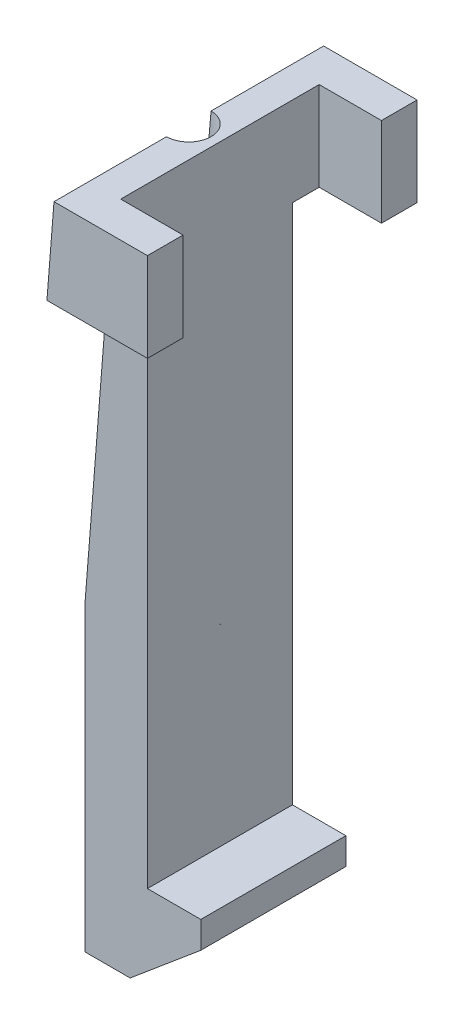
ISO-10303-21;
HEADER;
FILE_DESCRIPTION(('STEP AP214'),'2;1');
FILE_NAME('part.step','',(''),(''),'','','');
FILE_SCHEMA(('AUTOMOTIVE_DESIGN { 1 0 10303 214 1 1 1 1 }'));
ENDSEC;
DATA;
#1=APPLICATION_CONTEXT('core data for automotive mechanical design processes');
#2=APPLICATION_PROTOCOL_DEFINITION('international standard','automotive_design',2000,#1);
#3=PRODUCT_CONTEXT('',#1,'mechanical');
#4=PRODUCT('Part','Part','',(#3));
#5=PRODUCT_RELATED_PRODUCT_CATEGORY('part','',(#4));
#6=PRODUCT_DEFINITION_FORMATION('','',#4);
#7=PRODUCT_DEFINITION_CONTEXT('part definition',#1,'design');
#8=PRODUCT_DEFINITION('design','',#6,#7);
#9=PRODUCT_DEFINITION_SHAPE('','',#8);
#10=(LENGTH_UNIT() NAMED_UNIT(*) SI_UNIT(.MILLI.,.METRE.));
#11=(NAMED_UNIT(*) PLANE_ANGLE_UNIT() SI_UNIT($,.RADIAN.));
#12=(NAMED_UNIT(*) SI_UNIT($,.STERADIAN.) SOLID_ANGLE_UNIT());
#13=UNCERTAINTY_MEASURE_WITH_UNIT(LENGTH_MEASURE(1.E-05),#10,'distance_accuracy_value','');
#14=(GEOMETRIC_REPRESENTATION_CONTEXT(3) GLOBAL_UNCERTAINTY_ASSIGNED_CONTEXT((#13)) GLOBAL_UNIT_ASSIGNED_CONTEXT((#10,
#11,#12)) REPRESENTATION_CONTEXT('',''));
#15=CARTESIAN_POINT('',(0.,0.,0.));
#16=DIRECTION('',(0.,0.,1.));
#17=DIRECTION('',(1.,0.,0.));
#18=AXIS2_PLACEMENT_3D('',#15,#16,#17);
#19=CARTESIAN_POINT('',(0.,0.,-1.83));
#20=DIRECTION('',(0.,0.,-1.));
#21=DIRECTION('',(-1.,0.,0.));
#22=AXIS2_PLACEMENT_3D('',#19,#20,#21);
#23=PLANE('',#22);
#24=DIRECTION('',(0.,-1.,0.));
#25=VECTOR('',#24,1.);
#26=CARTESIAN_POINT('',(-1.2,-5.66735219900528,-1.83));
#27=LINE('',#26,#25);
#28=CARTESIAN_POINT('',(-1.2,-2.25367609950264,-1.83));
#29=VERTEX_POINT('',#28);
#30=CARTESIAN_POINT('',(-1.2,-5.66735219900528,-1.83));
#31=VERTEX_POINT('',#30);
#32=EDGE_CURVE('E251',#29,#31,#27,.T.);
#33=ORIENTED_EDGE('',*,*,#32,.F.);
#34=DIRECTION('',(0.0790508179017554,0.996870587483182,0.));
#35=VECTOR('',#34,1.);
#36=CARTESIAN_POINT('',(-1.01490374317144,0.0804808287019596,-1.83));
#37=LINE('',#36,#35);
#38=CARTESIAN_POINT('',(-0.929298977113306,1.16,-1.83));
#39=VERTEX_POINT('',#38);
#40=EDGE_CURVE('E181',#29,#39,#37,.T.);
#41=ORIENTED_EDGE('',*,*,#40,.T.);
#42=DIRECTION('',(-1.,0.,0.));
#43=VECTOR('',#42,1.);
#44=CARTESIAN_POINT('',(-0.500000000000001,1.16,-1.83));
#45=LINE('',#44,#43);
#46=CARTESIAN_POINT('',(-0.500000000000001,1.16,-1.83));
#47=VERTEX_POINT('',#46);
#48=EDGE_CURVE('E207',#47,#39,#45,.T.);
#49=ORIENTED_EDGE('',*,*,#48,.F.);
#50=DIRECTION('',(0.,1.,0.));
#51=VECTOR('',#50,1.);
#52=CARTESIAN_POINT('',(-0.500000000000001,2.16,-1.83));
#53=LINE('',#52,#51);
#54=CARTESIAN_POINT('',(-0.5,-4.7,-1.83));
#55=VERTEX_POINT('',#54);
#56=EDGE_CURVE('E267',#55,#47,#53,.T.);
#57=ORIENTED_EDGE('',*,*,#56,.F.);
#58=DIRECTION('',(-1.,0.,0.));
#59=VECTOR('',#58,1.);
#60=CARTESIAN_POINT('',(-0.5,-4.7,-1.83));
#61=LINE('',#60,#59);
#62=CARTESIAN_POINT('',(0.0999999999999996,-4.7,-1.83));
#63=VERTEX_POINT('',#62);
#64=EDGE_CURVE('E272',#63,#55,#61,.T.);
#65=ORIENTED_EDGE('',*,*,#64,.F.);
#66=DIRECTION('',(0.,1.,0.));
#67=VECTOR('',#66,1.);
#68=CARTESIAN_POINT('',(0.0999999999999996,-4.7,-1.83));
#69=LINE('',#68,#67);
#70=CARTESIAN_POINT('',(0.0999999999999996,-5.00079321743203,-1.83));
#71=VERTEX_POINT('',#70);
#72=EDGE_CURVE('E276',#71,#63,#69,.T.);
#73=ORIENTED_EDGE('',*,*,#72,.F.);
#74=DIRECTION('',(0.766044443118977,0.64278760968654,0.));
#75=VECTOR('',#74,1.);
#76=CARTESIAN_POINT('',(0.0999999999999996,-5.00079321743203,-1.83));
#77=LINE('',#76,#75);
#78=CARTESIAN_POINT('',(-0.694374060965859,-5.66735219900528,-1.83));
#79=VERTEX_POINT('',#78);
#80=EDGE_CURVE('E280',#79,#71,#77,.T.);
#81=ORIENTED_EDGE('',*,*,#80,.F.);
#82=DIRECTION('',(1.,0.,0.));
#83=VECTOR('',#82,1.);
#84=CARTESIAN_POINT('',(-0.694374060965859,-5.66735219900528,-1.83));
#85=LINE('',#84,#83);
#86=EDGE_CURVE('E284',#31,#79,#85,.T.);
#87=ORIENTED_EDGE('',*,*,#86,.F.);
#88=EDGE_LOOP('',(#33,#41,#49,#57,#65,#73,#81,#87));
#89=FACE_BOUND('',#88,.T.);
#90=ADVANCED_FACE('F37',(#89),#23,.T.);
#91=CARTESIAN_POINT('',(0.,0.,-0.2));
#92=DIRECTION('',(0.,0.,-1.));
#93=DIRECTION('',(-1.,0.,0.));
#94=AXIS2_PLACEMENT_3D('',#91,#92,#93);
#95=PLANE('',#94);
#96=DIRECTION('',(0.0790508179017554,0.996870587483182,0.));
#97=VECTOR('',#96,1.);
#98=CARTESIAN_POINT('',(-1.01490374317144,0.0804808287019595,-0.2));
#99=LINE('',#98,#97);
#100=CARTESIAN_POINT('',(-1.2,-2.25367609950264,-0.200000000000001));
#101=VERTEX_POINT('',#100);
#102=CARTESIAN_POINT('',(-0.929298977113306,1.16,-0.2));
#103=VERTEX_POINT('',#102);
#104=EDGE_CURVE('E187',#101,#103,#99,.T.);
#105=ORIENTED_EDGE('',*,*,#104,.F.);
#106=DIRECTION('',(0.,-1.,0.));
#107=VECTOR('',#106,1.);
#108=CARTESIAN_POINT('',(-1.2,-5.66735219900528,-0.2));
#109=LINE('',#108,#107);
#110=CARTESIAN_POINT('',(-1.2,-5.66735219900528,-0.2));
#111=VERTEX_POINT('',#110);
#112=EDGE_CURVE('E247',#101,#111,#109,.T.);
#113=ORIENTED_EDGE('',*,*,#112,.T.);
#114=DIRECTION('',(1.,0.,0.));
#115=VECTOR('',#114,1.);
#116=CARTESIAN_POINT('',(-0.694374060965859,-5.66735219900528,-0.2));
#117=LINE('',#116,#115);
#118=CARTESIAN_POINT('',(-0.694374060965859,-5.66735219900528,-0.2));
#119=VERTEX_POINT('',#118);
#120=EDGE_CURVE('E261',#111,#119,#117,.T.);
#121=ORIENTED_EDGE('',*,*,#120,.T.);
#122=DIRECTION('',(0.766044443118977,0.64278760968654,0.));
#123=VECTOR('',#122,1.);
#124=CARTESIAN_POINT('',(0.0999999999999996,-5.00079321743203,-0.2));
#125=LINE('',#124,#123);
#126=CARTESIAN_POINT('',(0.0999999999999996,-5.00079321743203,-0.2));
#127=VERTEX_POINT('',#126);
#128=EDGE_CURVE('E258',#119,#127,#125,.T.);
#129=ORIENTED_EDGE('',*,*,#128,.T.);
#130=DIRECTION('',(0.,1.,0.));
#131=VECTOR('',#130,1.);
#132=CARTESIAN_POINT('',(0.0999999999999996,-4.7,-0.2));
#133=LINE('',#132,#131);
#134=CARTESIAN_POINT('',(0.0999999999999996,-4.7,-0.2));
#135=VERTEX_POINT('',#134);
#136=EDGE_CURVE('E255',#127,#135,#133,.T.);
#137=ORIENTED_EDGE('',*,*,#136,.T.);
#138=DIRECTION('',(-1.,0.,0.));
#139=VECTOR('',#138,1.);
#140=CARTESIAN_POINT('',(-0.5,-4.7,-0.2));
#141=LINE('',#140,#139);
#142=CARTESIAN_POINT('',(-0.5,-4.7,-0.2));
#143=VERTEX_POINT('',#142);
#144=EDGE_CURVE('E252',#135,#143,#141,.T.);
#145=ORIENTED_EDGE('',*,*,#144,.T.);
#146=DIRECTION('',(0.,1.,0.));
#147=VECTOR('',#146,1.);
#148=CARTESIAN_POINT('',(-0.500000000000001,2.16,-0.2));
#149=LINE('',#148,#147);
#150=CARTESIAN_POINT('',(-0.500000000000001,1.16,-0.2));
#151=VERTEX_POINT('',#150);
#152=EDGE_CURVE('E248',#143,#151,#149,.T.);
#153=ORIENTED_EDGE('',*,*,#152,.T.);
#154=DIRECTION('',(-1.,0.,0.));
#155=VECTOR('',#154,1.);
#156=CARTESIAN_POINT('',(-0.500000000000001,1.16,-0.2));
#157=LINE('',#156,#155);
#158=EDGE_CURVE('E237',#151,#103,#157,.T.);
#159=ORIENTED_EDGE('',*,*,#158,.T.);
#160=EDGE_LOOP('',(#105,#113,#121,#129,#137,#145,#153,#159));
#161=FACE_BOUND('',#160,.T.);
#162=ADVANCED_FACE('F321',(#161),#95,.F.);
#163=CARTESIAN_POINT('',(-1.2,-5.66735219900528,-9.9645726064655));
#164=DIRECTION('',(-1.,0.,0.));
#165=DIRECTION('',(0.,0.,1.));
#166=AXIS2_PLACEMENT_3D('',#163,#164,#165);
#167=PLANE('',#166);
#168=ORIENTED_EDGE('',*,*,#112,.F.);
#169=DIRECTION('',(0.,0.,-1.));
#170=VECTOR('',#169,1.);
#171=CARTESIAN_POINT('',(-1.2,-2.25367609950264,0.5));
#172=LINE('',#171,#170);
#173=EDGE_CURVE('E172',#101,#29,#172,.T.);
#174=ORIENTED_EDGE('',*,*,#173,.T.);
#175=ORIENTED_EDGE('',*,*,#32,.T.);
#176=DIRECTION('',(0.,0.,1.));
#177=VECTOR('',#176,1.);
#178=CARTESIAN_POINT('',(-1.2,-5.66735219900528,-9.9645726064655));
#179=LINE('',#178,#177);
#180=EDGE_CURVE('E266',#31,#111,#179,.T.);
#181=ORIENTED_EDGE('',*,*,#180,.T.);
#182=EDGE_LOOP('',(#168,#174,#175,#181));
#183=FACE_BOUND('',#182,.T.);
#184=ADVANCED_FACE('F317',(#183),#167,.T.);
#185=CARTESIAN_POINT('',(-1.2,2.16,-9.9645726064655));
#186=DIRECTION('',(0.,1.,0.));
#187=DIRECTION('',(-1.,0.,0.));
#188=AXIS2_PLACEMENT_3D('',#185,#186,#187);
#189=PLANE('',#188);
#190=CARTESIAN_POINT('',(-0.850000000000001,2.16,-1.015));
#191=DIRECTION('',(0.,1.,0.));
#192=DIRECTION('',(-1.,0.,0.));
#193=AXIS2_PLACEMENT_3D('',#190,#191,#192);
#194=CIRCLE('',#193,0.25);
#195=CARTESIAN_POINT('',(-0.850000000000001,2.16,-0.764999999999999));
#196=VERTEX_POINT('',#195);
#197=CARTESIAN_POINT('',(-0.850000000000001,2.16,-1.265));
#198=VERTEX_POINT('',#197);
#199=EDGE_CURVE('E56',#196,#198,#194,.T.);
#200=ORIENTED_EDGE('',*,*,#199,.F.);
#201=DIRECTION('',(0.,0.,-1.));
#202=VECTOR('',#201,1.);
#203=CARTESIAN_POINT('',(-0.850000000000001,2.16,0.5));
#204=LINE('',#203,#202);
#205=CARTESIAN_POINT('',(-0.850000000000001,2.16,0.5));
#206=VERTEX_POINT('',#205);
#207=EDGE_CURVE('E164',#206,#196,#204,.T.);
#208=ORIENTED_EDGE('',*,*,#207,.F.);
#209=DIRECTION('',(-1.,0.,0.));
#210=VECTOR('',#209,1.);
#211=CARTESIAN_POINT('',(-0.500000000000001,2.16,0.5));
#212=LINE('',#211,#210);
#213=CARTESIAN_POINT('',(0.199999999999999,2.16,0.5));
#214=VERTEX_POINT('',#213);
#215=EDGE_CURVE('E238',#214,#206,#212,.T.);
#216=ORIENTED_EDGE('',*,*,#215,.F.);
#217=DIRECTION('',(0.,0.,-1.));
#218=VECTOR('',#217,1.);
#219=CARTESIAN_POINT('',(0.199999999999999,2.16,0.5));
#220=LINE('',#219,#218);
#221=CARTESIAN_POINT('',(0.199999999999999,2.16,0.1));
#222=VERTEX_POINT('',#221);
#223=EDGE_CURVE('E223',#214,#222,#220,.T.);
#224=ORIENTED_EDGE('',*,*,#223,.T.);
#225=DIRECTION('',(-1.,0.,0.));
#226=VECTOR('',#225,1.);
#227=CARTESIAN_POINT('',(0.199999999999999,2.16,0.1));
#228=LINE('',#227,#226);
#229=CARTESIAN_POINT('',(-0.500000000000001,2.16,0.0999999999999994));
#230=VERTEX_POINT('',#229);
#231=EDGE_CURVE('E229',#222,#230,#228,.T.);
#232=ORIENTED_EDGE('',*,*,#231,.T.);
#233=DIRECTION('',(0.,0.,1.));
#234=VECTOR('',#233,1.);
#235=CARTESIAN_POINT('',(-0.500000000000001,2.16,-9.9645726064655));
#236=LINE('',#235,#234);
#237=CARTESIAN_POINT('',(-0.500000000000001,2.16,-2.13));
#238=VERTEX_POINT('',#237);
#239=EDGE_CURVE('E270',#238,#230,#236,.T.);
#240=ORIENTED_EDGE('',*,*,#239,.F.);
#241=DIRECTION('',(-1.,0.,0.));
#242=VECTOR('',#241,1.);
#243=CARTESIAN_POINT('',(0.199999999999999,2.16,-2.13));
#244=LINE('',#243,#242);
#245=CARTESIAN_POINT('',(0.199999999999999,2.16,-2.13));
#246=VERTEX_POINT('',#245);
#247=EDGE_CURVE('E205',#246,#238,#244,.T.);
#248=ORIENTED_EDGE('',*,*,#247,.F.);
#249=DIRECTION('',(0.,0.,1.));
#250=VECTOR('',#249,1.);
#251=CARTESIAN_POINT('',(0.199999999999999,2.16,-2.53));
#252=LINE('',#251,#250);
#253=CARTESIAN_POINT('',(0.199999999999999,2.16,-2.53));
#254=VERTEX_POINT('',#253);
#255=EDGE_CURVE('E196',#254,#246,#252,.T.);
#256=ORIENTED_EDGE('',*,*,#255,.F.);
#257=DIRECTION('',(-1.,0.,0.));
#258=VECTOR('',#257,1.);
#259=CARTESIAN_POINT('',(-0.500000000000001,2.16,-2.53));
#260=LINE('',#259,#258);
#261=CARTESIAN_POINT('',(-0.850000000000001,2.16,-2.53));
#262=VERTEX_POINT('',#261);
#263=EDGE_CURVE('E208',#254,#262,#260,.T.);
#264=ORIENTED_EDGE('',*,*,#263,.T.);
#265=EDGE_CURVE('E167',#198,#262,#204,.T.);
#266=ORIENTED_EDGE('',*,*,#265,.F.);
#267=EDGE_LOOP('',(#200,#208,#216,#224,#232,#240,#248,#256,#264,#266));
#268=FACE_BOUND('',#267,.T.);
#269=ADVANCED_FACE('F163',(#268),#189,.T.);
#270=CARTESIAN_POINT('',(-0.500000000000001,1.16,0.5));
#271=DIRECTION('',(0.,-1.,0.));
#272=DIRECTION('',(1.,0.,0.));
#273=AXIS2_PLACEMENT_3D('',#270,#271,#272);
#274=PLANE('',#273);
#275=DIRECTION('',(-1.,0.,0.));
#276=VECTOR('',#275,1.);
#277=CARTESIAN_POINT('',(-0.500000000000001,1.16,0.5));
#278=LINE('',#277,#276);
#279=CARTESIAN_POINT('',(0.199999999999999,1.16,0.5));
#280=VERTEX_POINT('',#279);
#281=CARTESIAN_POINT('',(-0.929298977113306,1.16,0.5));
#282=VERTEX_POINT('',#281);
#283=EDGE_CURVE('E240',#280,#282,#278,.T.);
#284=ORIENTED_EDGE('',*,*,#283,.T.);
#285=DIRECTION('',(0.,0.,-1.));
#286=VECTOR('',#285,1.);
#287=CARTESIAN_POINT('',(-0.929298977113306,1.16,0.5));
#288=LINE('',#287,#286);
#289=EDGE_CURVE('E184',#282,#103,#288,.T.);
#290=ORIENTED_EDGE('',*,*,#289,.T.);
#291=ORIENTED_EDGE('',*,*,#158,.F.);
#292=DIRECTION('',(0.,0.,-1.));
#293=VECTOR('',#292,1.);
#294=CARTESIAN_POINT('',(-0.500000000000001,1.16,0.5));
#295=LINE('',#294,#293);
#296=CARTESIAN_POINT('',(-0.500000000000001,1.16,0.1));
#297=VERTEX_POINT('',#296);
#298=EDGE_CURVE('E243',#297,#151,#295,.T.);
#299=ORIENTED_EDGE('',*,*,#298,.F.);
#300=DIRECTION('',(-1.,0.,0.));
#301=VECTOR('',#300,1.);
#302=CARTESIAN_POINT('',(0.199999999999999,1.16,0.1));
#303=LINE('',#302,#301);
#304=CARTESIAN_POINT('',(0.199999999999999,1.16,0.1));
#305=VERTEX_POINT('',#304);
#306=EDGE_CURVE('E234',#305,#297,#303,.T.);
#307=ORIENTED_EDGE('',*,*,#306,.F.);
#308=DIRECTION('',(0.,0.,-1.));
#309=VECTOR('',#308,1.);
#310=CARTESIAN_POINT('',(0.199999999999999,1.16,0.5));
#311=LINE('',#310,#309);
#312=EDGE_CURVE('E218',#280,#305,#311,.T.);
#313=ORIENTED_EDGE('',*,*,#312,.F.);
#314=EDGE_LOOP('',(#284,#290,#291,#299,#307,#313));
#315=FACE_BOUND('',#314,.T.);
#316=ADVANCED_FACE('F326',(#315),#274,.T.);
#317=CARTESIAN_POINT('',(0.,0.,0.5));
#318=DIRECTION('',(0.,0.,1.));
#319=DIRECTION('',(1.,0.,0.));
#320=AXIS2_PLACEMENT_3D('',#317,#318,#319);
#321=PLANE('',#320);
#322=ORIENTED_EDGE('',*,*,#215,.T.);
#323=DIRECTION('',(0.0790508179017554,0.996870587483181,0.));
#324=VECTOR('',#323,1.);
#325=CARTESIAN_POINT('',(-0.850000000000001,2.16,0.5));
#326=LINE('',#325,#324);
#327=EDGE_CURVE('E171',#282,#206,#326,.T.);
#328=ORIENTED_EDGE('',*,*,#327,.F.);
#329=ORIENTED_EDGE('',*,*,#283,.F.);
#330=DIRECTION('',(0.,1.,0.));
#331=VECTOR('',#330,1.);
#332=CARTESIAN_POINT('',(0.199999999999999,1.16,0.5));
#333=LINE('',#332,#331);
#334=EDGE_CURVE('E226',#280,#214,#333,.T.);
#335=ORIENTED_EDGE('',*,*,#334,.T.);
#336=EDGE_LOOP('',(#322,#328,#329,#335));
#337=FACE_BOUND('',#336,.T.);
#338=ADVANCED_FACE('F330',(#337),#321,.T.);
#339=CARTESIAN_POINT('',(-0.500000000000001,1.16,-2.53));
#340=DIRECTION('',(0.,1.,0.));
#341=DIRECTION('',(-1.,0.,0.));
#342=AXIS2_PLACEMENT_3D('',#339,#340,#341);
#343=PLANE('',#342);
#344=DIRECTION('',(0.,0.,1.));
#345=VECTOR('',#344,1.);
#346=CARTESIAN_POINT('',(-0.929298977113306,1.16,-2.53));
#347=LINE('',#346,#345);
#348=CARTESIAN_POINT('',(-0.929298977113306,1.16,-2.53));
#349=VERTEX_POINT('',#348);
#350=EDGE_CURVE('E175',#349,#39,#347,.T.);
#351=ORIENTED_EDGE('',*,*,#350,.F.);
#352=DIRECTION('',(-1.,0.,0.));
#353=VECTOR('',#352,1.);
#354=CARTESIAN_POINT('',(-0.500000000000001,1.16,-2.53));
#355=LINE('',#354,#353);
#356=CARTESIAN_POINT('',(0.199999999999999,1.16,-2.53));
#357=VERTEX_POINT('',#356);
#358=EDGE_CURVE('E210',#357,#349,#355,.T.);
#359=ORIENTED_EDGE('',*,*,#358,.F.);
#360=DIRECTION('',(0.,0.,1.));
#361=VECTOR('',#360,1.);
#362=CARTESIAN_POINT('',(0.199999999999999,1.16,-2.53));
#363=LINE('',#362,#361);
#364=CARTESIAN_POINT('',(0.199999999999999,1.16,-2.13));
#365=VERTEX_POINT('',#364);
#366=EDGE_CURVE('E190',#357,#365,#363,.T.);
#367=ORIENTED_EDGE('',*,*,#366,.T.);
#368=DIRECTION('',(-1.,0.,0.));
#369=VECTOR('',#368,1.);
#370=CARTESIAN_POINT('',(0.199999999999999,1.16,-2.13));
#371=LINE('',#370,#369);
#372=CARTESIAN_POINT('',(-0.500000000000001,1.16,-2.13));
#373=VERTEX_POINT('',#372);
#374=EDGE_CURVE('E201',#365,#373,#371,.T.);
#375=ORIENTED_EDGE('',*,*,#374,.T.);
#376=DIRECTION('',(0.,0.,1.));
#377=VECTOR('',#376,1.);
#378=CARTESIAN_POINT('',(-0.500000000000001,1.16,-2.53));
#379=LINE('',#378,#377);
#380=EDGE_CURVE('E213',#373,#47,#379,.T.);
#381=ORIENTED_EDGE('',*,*,#380,.T.);
#382=ORIENTED_EDGE('',*,*,#48,.T.);
#383=EDGE_LOOP('',(#351,#359,#367,#375,#381,#382));
#384=FACE_BOUND('',#383,.T.);
#385=ADVANCED_FACE('F308',(#384),#343,.F.);
#386=CARTESIAN_POINT('',(0.,0.,-2.53));
#387=DIRECTION('',(0.,0.,-1.));
#388=DIRECTION('',(1.,0.,0.));
#389=AXIS2_PLACEMENT_3D('',#386,#387,#388);
#390=PLANE('',#389);
#391=ORIENTED_EDGE('',*,*,#358,.T.);
#392=DIRECTION('',(0.0790508179017554,0.996870587483182,0.));
#393=VECTOR('',#392,1.);
#394=CARTESIAN_POINT('',(-1.01490374317144,0.0804808287019595,-2.53));
#395=LINE('',#394,#393);
#396=EDGE_CURVE('E44',#349,#262,#395,.T.);
#397=ORIENTED_EDGE('',*,*,#396,.T.);
#398=ORIENTED_EDGE('',*,*,#263,.F.);
#399=DIRECTION('',(0.,1.,0.));
#400=VECTOR('',#399,1.);
#401=CARTESIAN_POINT('',(0.199999999999999,1.16,-2.53));
#402=LINE('',#401,#400);
#403=EDGE_CURVE('E193',#357,#254,#402,.T.);
#404=ORIENTED_EDGE('',*,*,#403,.F.);
#405=EDGE_LOOP('',(#391,#397,#398,#404));
#406=FACE_BOUND('',#405,.T.);
#407=ADVANCED_FACE('F297',(#406),#390,.T.);
#408=CARTESIAN_POINT('',(-0.500000000000001,2.16,-9.9645726064655));
#409=DIRECTION('',(1.,0.,0.));
#410=DIRECTION('',(0.,1.,0.));
#411=AXIS2_PLACEMENT_3D('',#408,#409,#410);
#412=PLANE('',#411);
#413=DIRECTION('',(0.,1.,0.));
#414=VECTOR('',#413,1.);
#415=CARTESIAN_POINT('',(-0.500000000000001,1.16,-2.13));
#416=LINE('',#415,#414);
#417=EDGE_CURVE('E189',#373,#238,#416,.T.);
#418=ORIENTED_EDGE('',*,*,#417,.T.);
#419=ORIENTED_EDGE('',*,*,#239,.T.);
#420=DIRECTION('',(0.,1.,0.));
#421=VECTOR('',#420,1.);
#422=CARTESIAN_POINT('',(-0.500000000000001,1.16,0.1));
#423=LINE('',#422,#421);
#424=EDGE_CURVE('E217',#297,#230,#423,.T.);
#425=ORIENTED_EDGE('',*,*,#424,.F.);
#426=ORIENTED_EDGE('',*,*,#298,.T.);
#427=ORIENTED_EDGE('',*,*,#152,.F.);
#428=DIRECTION('',(0.,0.,1.));
#429=VECTOR('',#428,1.);
#430=CARTESIAN_POINT('',(-0.5,-4.7,-9.9645726064655));
#431=LINE('',#430,#429);
#432=EDGE_CURVE('E271',#55,#143,#431,.T.);
#433=ORIENTED_EDGE('',*,*,#432,.F.);
#434=ORIENTED_EDGE('',*,*,#56,.T.);
#435=ORIENTED_EDGE('',*,*,#380,.F.);
#436=EDGE_LOOP('',(#418,#419,#425,#426,#427,#433,#434,#435));
#437=FACE_BOUND('',#436,.T.);
#438=ADVANCED_FACE('F350',(#437),#412,.T.);
#439=CARTESIAN_POINT('',(-0.694374060965859,-5.66735219900528,-9.9645726064655));
#440=DIRECTION('',(0.,-1.,0.));
#441=DIRECTION('',(0.,0.,-1.));
#442=AXIS2_PLACEMENT_3D('',#439,#440,#441);
#443=PLANE('',#442);
#444=CARTESIAN_POINT('',(-0.850000000000007,-5.66735219900528,-1.015));
#445=DIRECTION('',(0.,1.,0.));
#446=DIRECTION('',(-1.,0.,0.));
#447=AXIS2_PLACEMENT_3D('',#444,#445,#446);
#448=CIRCLE('',#447,0.25);
#449=CARTESIAN_POINT('',(-0.694374060965859,-5.66735219900528,-1.21065420286756));
#450=VERTEX_POINT('',#449);
#451=CARTESIAN_POINT('',(-0.694374060965859,-5.66735219900528,-0.819345797132441));
#452=VERTEX_POINT('',#451);
#453=EDGE_CURVE('E50',#450,#452,#448,.T.);
#454=ORIENTED_EDGE('',*,*,#453,.T.);
#455=DIRECTION('',(0.,0.,1.));
#456=VECTOR('',#455,1.);
#457=CARTESIAN_POINT('',(-0.694374060965859,-5.66735219900528,-9.9645726064655));
#458=LINE('',#457,#456);
#459=EDGE_CURVE('E287',#452,#119,#458,.T.);
#460=ORIENTED_EDGE('',*,*,#459,.T.);
#461=ORIENTED_EDGE('',*,*,#120,.F.);
#462=ORIENTED_EDGE('',*,*,#180,.F.);
#463=ORIENTED_EDGE('',*,*,#86,.T.);
#464=EDGE_CURVE('E283',#79,#450,#458,.T.);
#465=ORIENTED_EDGE('',*,*,#464,.T.);
#466=EDGE_LOOP('',(#454,#460,#461,#462,#463,#465));
#467=FACE_BOUND('',#466,.T.);
#468=ADVANCED_FACE('F335',(#467),#443,.T.);
#469=CARTESIAN_POINT('',(0.0999999999999996,-5.00079321743203,-9.9645726064655));
#470=DIRECTION('',(0.64278760968654,-0.766044443118977,0.));
#471=DIRECTION('',(0.766044443118977,0.64278760968654,0.));
#472=AXIS2_PLACEMENT_3D('',#469,#470,#471);
#473=PLANE('',#472);
#474=CARTESIAN_POINT('',(-0.850000000000007,-5.79793786705045,-1.015));
#475=DIRECTION('',(0.64278760968654,-0.766044443118977,0.));
#476=DIRECTION('',(0.766044443118977,0.64278760968654,0.));
#477=AXIS2_PLACEMENT_3D('',#474,#475,#476);
#478=ELLIPSE('',#477,0.32635182233307,0.25);
#479=EDGE_CURVE('E331',#450,#452,#478,.T.);
#480=ORIENTED_EDGE('',*,*,#479,.F.);
#481=ORIENTED_EDGE('',*,*,#464,.F.);
#482=ORIENTED_EDGE('',*,*,#80,.T.);
#483=DIRECTION('',(0.,0.,1.));
#484=VECTOR('',#483,1.);
#485=CARTESIAN_POINT('',(0.0999999999999996,-5.00079321743203,-9.9645726064655));
#486=LINE('',#485,#484);
#487=EDGE_CURVE('E279',#71,#127,#486,.T.);
#488=ORIENTED_EDGE('',*,*,#487,.T.);
#489=ORIENTED_EDGE('',*,*,#128,.F.);
#490=ORIENTED_EDGE('',*,*,#459,.F.);
#491=EDGE_LOOP('',(#480,#481,#482,#488,#489,#490));
#492=FACE_BOUND('',#491,.T.);
#493=ADVANCED_FACE('F339',(#492),#473,.T.);
#494=CARTESIAN_POINT('',(0.0999999999999996,-4.7,-9.9645726064655));
#495=DIRECTION('',(1.,0.,0.));
#496=DIRECTION('',(0.,1.,0.));
#497=AXIS2_PLACEMENT_3D('',#494,#495,#496);
#498=PLANE('',#497);
#499=ORIENTED_EDGE('',*,*,#487,.F.);
#500=ORIENTED_EDGE('',*,*,#72,.T.);
#501=DIRECTION('',(0.,0.,1.));
#502=VECTOR('',#501,1.);
#503=CARTESIAN_POINT('',(0.0999999999999996,-4.7,-9.9645726064655));
#504=LINE('',#503,#502);
#505=EDGE_CURVE('E275',#63,#135,#504,.T.);
#506=ORIENTED_EDGE('',*,*,#505,.T.);
#507=ORIENTED_EDGE('',*,*,#136,.F.);
#508=EDGE_LOOP('',(#499,#500,#506,#507));
#509=FACE_BOUND('',#508,.T.);
#510=ADVANCED_FACE('F344',(#509),#498,.T.);
#511=CARTESIAN_POINT('',(-0.5,-4.7,-9.9645726064655));
#512=DIRECTION('',(0.,1.,0.));
#513=DIRECTION('',(0.,0.,1.));
#514=AXIS2_PLACEMENT_3D('',#511,#512,#513);
#515=PLANE('',#514);
#516=ORIENTED_EDGE('',*,*,#505,.F.);
#517=ORIENTED_EDGE('',*,*,#64,.T.);
#518=ORIENTED_EDGE('',*,*,#432,.T.);
#519=ORIENTED_EDGE('',*,*,#144,.F.);
#520=EDGE_LOOP('',(#516,#517,#518,#519));
#521=FACE_BOUND('',#520,.T.);
#522=ADVANCED_FACE('F347',(#521),#515,.T.);
#523=CARTESIAN_POINT('',(0.199999999999999,1.16,0.1));
#524=DIRECTION('',(0.,0.,1.));
#525=DIRECTION('',(0.,-1.,0.));
#526=AXIS2_PLACEMENT_3D('',#523,#524,#525);
#527=PLANE('',#526);
#528=ORIENTED_EDGE('',*,*,#424,.T.);
#529=ORIENTED_EDGE('',*,*,#231,.F.);
#530=DIRECTION('',(0.,1.,0.));
#531=VECTOR('',#530,1.);
#532=CARTESIAN_POINT('',(0.199999999999999,1.16,0.1));
#533=LINE('',#532,#531);
#534=EDGE_CURVE('E221',#305,#222,#533,.T.);
#535=ORIENTED_EDGE('',*,*,#534,.F.);
#536=ORIENTED_EDGE('',*,*,#306,.T.);
#537=EDGE_LOOP('',(#528,#529,#535,#536));
#538=FACE_BOUND('',#537,.T.);
#539=ADVANCED_FACE('F354',(#538),#527,.F.);
#540=CARTESIAN_POINT('',(0.199999999999999,0.,0.));
#541=DIRECTION('',(1.,0.,0.));
#542=DIRECTION('',(0.,1.,0.));
#543=AXIS2_PLACEMENT_3D('',#540,#541,#542);
#544=PLANE('',#543);
#545=ORIENTED_EDGE('',*,*,#312,.T.);
#546=ORIENTED_EDGE('',*,*,#534,.T.);
#547=ORIENTED_EDGE('',*,*,#223,.F.);
#548=ORIENTED_EDGE('',*,*,#334,.F.);
#549=EDGE_LOOP('',(#545,#546,#547,#548));
#550=FACE_BOUND('',#549,.T.);
#551=ADVANCED_FACE('F358',(#550),#544,.T.);
#552=CARTESIAN_POINT('',(0.199999999999999,1.16,-2.13));
#553=DIRECTION('',(0.,0.,1.));
#554=DIRECTION('',(0.,-1.,0.));
#555=AXIS2_PLACEMENT_3D('',#552,#553,#554);
#556=PLANE('',#555);
#557=ORIENTED_EDGE('',*,*,#417,.F.);
#558=ORIENTED_EDGE('',*,*,#374,.F.);
#559=DIRECTION('',(0.,1.,0.));
#560=VECTOR('',#559,1.);
#561=CARTESIAN_POINT('',(0.199999999999999,1.16,-2.13));
#562=LINE('',#561,#560);
#563=EDGE_CURVE('E198',#365,#246,#562,.T.);
#564=ORIENTED_EDGE('',*,*,#563,.T.);
#565=ORIENTED_EDGE('',*,*,#247,.T.);
#566=EDGE_LOOP('',(#557,#558,#564,#565));
#567=FACE_BOUND('',#566,.T.);
#568=ADVANCED_FACE('F360',(#567),#556,.T.);
#569=CARTESIAN_POINT('',(0.199999999999999,0.,-2.03));
#570=DIRECTION('',(1.,0.,0.));
#571=DIRECTION('',(0.,1.,0.));
#572=AXIS2_PLACEMENT_3D('',#569,#570,#571);
#573=PLANE('',#572);
#574=ORIENTED_EDGE('',*,*,#366,.F.);
#575=ORIENTED_EDGE('',*,*,#403,.T.);
#576=ORIENTED_EDGE('',*,*,#255,.T.);
#577=ORIENTED_EDGE('',*,*,#563,.F.);
#578=EDGE_LOOP('',(#574,#575,#576,#577));
#579=FACE_BOUND('',#578,.T.);
#580=ADVANCED_FACE('F306',(#579),#573,.T.);
#581=CARTESIAN_POINT('',(-0.850000000000001,2.16,0.5));
#582=DIRECTION('',(-0.996870587483182,0.0790508179017554,0.));
#583=DIRECTION('',(-0.0790508179017554,-0.996870587483182,0.));
#584=AXIS2_PLACEMENT_3D('',#581,#582,#583);
#585=PLANE('',#584);
#586=CARTESIAN_POINT('',(-0.850000000000001,2.16,-1.015));
#587=DIRECTION('',(-0.996870587483182,0.0790508179017554,0.));
#588=DIRECTION('',(0.0790508179017554,0.996870587483182,0.));
#589=AXIS2_PLACEMENT_3D('',#586,#587,#588);
#590=ELLIPSE('',#589,3.16252262324095,0.25);
#591=EDGE_CURVE('E11',#198,#196,#590,.T.);
#592=ORIENTED_EDGE('',*,*,#591,.F.);
#593=ORIENTED_EDGE('',*,*,#265,.T.);
#594=ORIENTED_EDGE('',*,*,#396,.F.);
#595=ORIENTED_EDGE('',*,*,#350,.T.);
#596=ORIENTED_EDGE('',*,*,#40,.F.);
#597=ORIENTED_EDGE('',*,*,#173,.F.);
#598=ORIENTED_EDGE('',*,*,#104,.T.);
#599=ORIENTED_EDGE('',*,*,#289,.F.);
#600=ORIENTED_EDGE('',*,*,#327,.T.);
#601=ORIENTED_EDGE('',*,*,#207,.T.);
#602=EDGE_LOOP('',(#592,#593,#594,#595,#596,#597,#598,#599,#600,#601));
#603=FACE_BOUND('',#602,.T.);
#604=ADVANCED_FACE('F169',(#603),#585,.T.);
#605=CARTESIAN_POINT('',(-0.850000000000007,-5.66735219900528,-1.015));
#606=DIRECTION('',(0.,1.,0.));
#607=DIRECTION('',(-1.,0.,0.));
#608=AXIS2_PLACEMENT_3D('',#605,#606,#607);
#609=CYLINDRICAL_SURFACE('',#608,0.25);
#610=ORIENTED_EDGE('',*,*,#479,.T.);
#611=ORIENTED_EDGE('',*,*,#453,.F.);
#612=EDGE_LOOP('',(#610,#611));
#613=FACE_BOUND('',#612,.T.);
#614=ORIENTED_EDGE('',*,*,#591,.T.);
#615=ORIENTED_EDGE('',*,*,#199,.T.);
#616=EDGE_LOOP('',(#614,#615));
#617=FACE_BOUND('',#616,.T.);
#618=ADVANCED_FACE('F157',(#613,#617),#609,.F.);
#619=CLOSED_SHELL('',(#90,#162,#184,#269,#316,#338,#385,#407,#438,#468,#493,#510,#522,#539,#551,
#568,#580,#604,#618));
#620=MANIFOLD_SOLID_BREP('B2',#619);
#621=ADVANCED_BREP_SHAPE_REPRESENTATION('',(#18,#620),#14);
#622=SHAPE_DEFINITION_REPRESENTATION(#9,#621);
ENDSEC;
END-ISO-10303-21;
